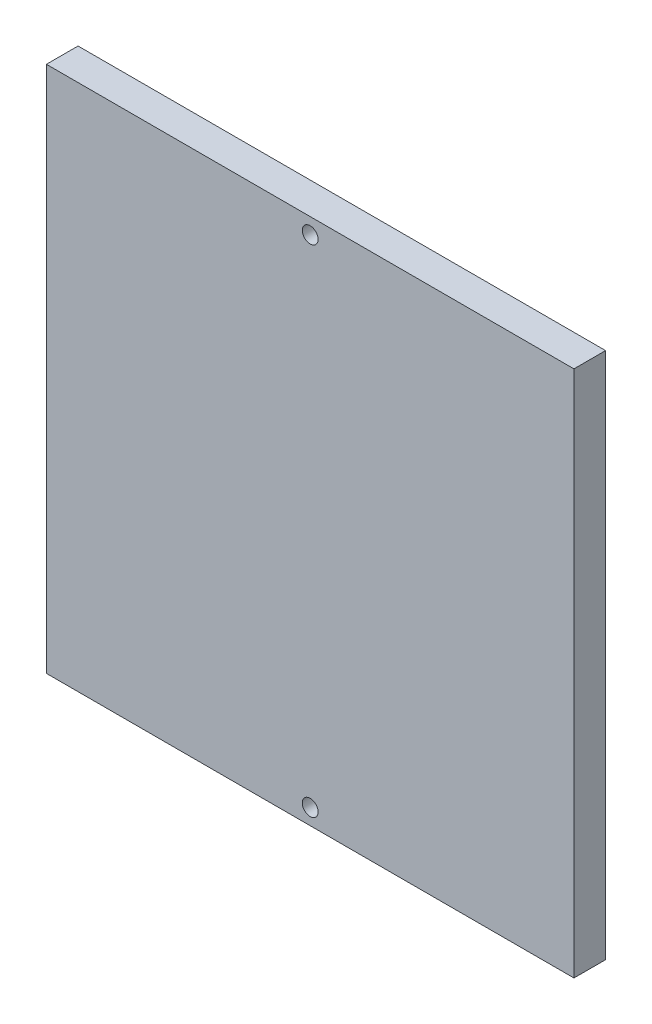
ISO-10303-21;
HEADER;
FILE_DESCRIPTION(('STEP AP214'),'2;1');
FILE_NAME('part.step','',(''),(''),'','','');
FILE_SCHEMA(('AUTOMOTIVE_DESIGN { 1 0 10303 214 1 1 1 1 }'));
ENDSEC;
DATA;
#1=APPLICATION_CONTEXT('core data for automotive mechanical design processes');
#2=APPLICATION_PROTOCOL_DEFINITION('international standard','automotive_design',2000,#1);
#3=PRODUCT_CONTEXT('',#1,'mechanical');
#4=PRODUCT('Part','Part','',(#3));
#5=PRODUCT_RELATED_PRODUCT_CATEGORY('part','',(#4));
#6=PRODUCT_DEFINITION_FORMATION('','',#4);
#7=PRODUCT_DEFINITION_CONTEXT('part definition',#1,'design');
#8=PRODUCT_DEFINITION('design','',#6,#7);
#9=PRODUCT_DEFINITION_SHAPE('','',#8);
#10=(LENGTH_UNIT() NAMED_UNIT(*) SI_UNIT(.MILLI.,.METRE.));
#11=(NAMED_UNIT(*) PLANE_ANGLE_UNIT() SI_UNIT($,.RADIAN.));
#12=(NAMED_UNIT(*) SI_UNIT($,.STERADIAN.) SOLID_ANGLE_UNIT());
#13=UNCERTAINTY_MEASURE_WITH_UNIT(LENGTH_MEASURE(1.E-05),#10,'distance_accuracy_value','');
#14=(GEOMETRIC_REPRESENTATION_CONTEXT(3) GLOBAL_UNCERTAINTY_ASSIGNED_CONTEXT((#13)) GLOBAL_UNIT_ASSIGNED_CONTEXT((#10,
#11,#12)) REPRESENTATION_CONTEXT('',''));
#15=CARTESIAN_POINT('',(0.,0.,0.));
#16=DIRECTION('',(0.,0.,1.));
#17=DIRECTION('',(1.,0.,0.));
#18=AXIS2_PLACEMENT_3D('',#15,#16,#17);
#19=CARTESIAN_POINT('',(0.,0.,6.));
#20=DIRECTION('',(0.,0.,-1.));
#21=DIRECTION('',(-1.,0.,0.));
#22=AXIS2_PLACEMENT_3D('',#19,#20,#21);
#23=PLANE('',#22);
#24=DIRECTION('',(0.,-1.,0.));
#25=VECTOR('',#24,1.);
#26=CARTESIAN_POINT('',(0.,-138.388923903618,6.));
#27=LINE('',#26,#25);
#28=CARTESIAN_POINT('',(0.,-38.3889239036183,6.));
#29=VERTEX_POINT('',#28);
#30=CARTESIAN_POINT('',(0.,-138.388923903618,6.));
#31=VERTEX_POINT('',#30);
#32=EDGE_CURVE('E85',#29,#31,#27,.T.);
#33=ORIENTED_EDGE('',*,*,#32,.T.);
#34=DIRECTION('',(1.,0.,0.));
#35=VECTOR('',#34,1.);
#36=CARTESIAN_POINT('',(100.,-138.388923903618,6.));
#37=LINE('',#36,#35);
#38=CARTESIAN_POINT('',(100.,-138.388923903618,6.));
#39=VERTEX_POINT('',#38);
#40=EDGE_CURVE('E80',#31,#39,#37,.T.);
#41=ORIENTED_EDGE('',*,*,#40,.T.);
#42=DIRECTION('',(0.,1.,0.));
#43=VECTOR('',#42,1.);
#44=CARTESIAN_POINT('',(100.,-38.3889239036183,6.));
#45=LINE('',#44,#43);
#46=CARTESIAN_POINT('',(100.,-38.3889239036183,6.));
#47=VERTEX_POINT('',#46);
#48=EDGE_CURVE('E83',#39,#47,#45,.T.);
#49=ORIENTED_EDGE('',*,*,#48,.T.);
#50=DIRECTION('',(-1.,0.,0.));
#51=VECTOR('',#50,1.);
#52=CARTESIAN_POINT('',(0.,-38.3889239036183,6.));
#53=LINE('',#52,#51);
#54=EDGE_CURVE('E50',#47,#29,#53,.T.);
#55=ORIENTED_EDGE('',*,*,#54,.T.);
#56=EDGE_LOOP('',(#33,#41,#49,#55));
#57=FACE_BOUND('',#56,.T.);
#58=CARTESIAN_POINT('',(50.,-41.3889239036183,6.));
#59=DIRECTION('',(0.,0.,1.));
#60=DIRECTION('',(1.,0.,0.));
#61=AXIS2_PLACEMENT_3D('',#58,#59,#60);
#62=CIRCLE('',#61,1.5);
#63=CARTESIAN_POINT('',(51.5,-41.3889239036183,6.));
#64=VERTEX_POINT('',#63);
#65=EDGE_CURVE('E100',#64,#64,#62,.T.);
#66=ORIENTED_EDGE('',*,*,#65,.F.);
#67=EDGE_LOOP('',(#66));
#68=FACE_BOUND('',#67,.T.);
#69=CARTESIAN_POINT('',(50.,-135.388923903618,6.));
#70=DIRECTION('',(0.,0.,1.));
#71=DIRECTION('',(1.,0.,0.));
#72=AXIS2_PLACEMENT_3D('',#69,#70,#71);
#73=CIRCLE('',#72,1.5);
#74=CARTESIAN_POINT('',(51.5,-135.388923903618,6.));
#75=VERTEX_POINT('',#74);
#76=EDGE_CURVE('E115',#75,#75,#73,.T.);
#77=ORIENTED_EDGE('',*,*,#76,.F.);
#78=EDGE_LOOP('',(#77));
#79=FACE_BOUND('',#78,.T.);
#80=ADVANCED_FACE('F33',(#57,#68,#79),#23,.F.);
#81=CARTESIAN_POINT('',(0.,0.,0.));
#82=DIRECTION('',(0.,0.,-1.));
#83=DIRECTION('',(-1.,0.,0.));
#84=AXIS2_PLACEMENT_3D('',#81,#82,#83);
#85=PLANE('',#84);
#86=CARTESIAN_POINT('',(50.,-41.3889239036183,0.));
#87=DIRECTION('',(0.,0.,1.));
#88=DIRECTION('',(1.,0.,0.));
#89=AXIS2_PLACEMENT_3D('',#86,#87,#88);
#90=CIRCLE('',#89,1.5);
#91=CARTESIAN_POINT('',(51.5,-41.3889239036183,0.));
#92=VERTEX_POINT('',#91);
#93=EDGE_CURVE('E112',#92,#92,#90,.T.);
#94=ORIENTED_EDGE('',*,*,#93,.T.);
#95=EDGE_LOOP('',(#94));
#96=FACE_BOUND('',#95,.T.);
#97=DIRECTION('',(0.,-1.,0.));
#98=VECTOR('',#97,1.);
#99=CARTESIAN_POINT('',(0.,-138.388923903618,0.));
#100=LINE('',#99,#98);
#101=CARTESIAN_POINT('',(0.,-38.3889239036183,0.));
#102=VERTEX_POINT('',#101);
#103=CARTESIAN_POINT('',(0.,-138.388923903618,0.));
#104=VERTEX_POINT('',#103);
#105=EDGE_CURVE('E97',#102,#104,#100,.T.);
#106=ORIENTED_EDGE('',*,*,#105,.F.);
#107=DIRECTION('',(-1.,0.,0.));
#108=VECTOR('',#107,1.);
#109=CARTESIAN_POINT('',(0.,-38.3889239036183,0.));
#110=LINE('',#109,#108);
#111=CARTESIAN_POINT('',(100.,-38.3889239036183,0.));
#112=VERTEX_POINT('',#111);
#113=EDGE_CURVE('E73',#112,#102,#110,.T.);
#114=ORIENTED_EDGE('',*,*,#113,.F.);
#115=DIRECTION('',(0.,1.,0.));
#116=VECTOR('',#115,1.);
#117=CARTESIAN_POINT('',(100.,-38.3889239036183,0.));
#118=LINE('',#117,#116);
#119=CARTESIAN_POINT('',(100.,-138.388923903618,0.));
#120=VERTEX_POINT('',#119);
#121=EDGE_CURVE('E67',#120,#112,#118,.T.);
#122=ORIENTED_EDGE('',*,*,#121,.F.);
#123=DIRECTION('',(1.,0.,0.));
#124=VECTOR('',#123,1.);
#125=CARTESIAN_POINT('',(100.,-138.388923903618,0.));
#126=LINE('',#125,#124);
#127=EDGE_CURVE('E89',#104,#120,#126,.T.);
#128=ORIENTED_EDGE('',*,*,#127,.F.);
#129=EDGE_LOOP('',(#106,#114,#122,#128));
#130=FACE_BOUND('',#129,.T.);
#131=CARTESIAN_POINT('',(50.,-135.388923903618,0.));
#132=DIRECTION('',(0.,0.,1.));
#133=DIRECTION('',(1.,0.,0.));
#134=AXIS2_PLACEMENT_3D('',#131,#132,#133);
#135=CIRCLE('',#134,1.5);
#136=CARTESIAN_POINT('',(51.5,-135.388923903618,0.));
#137=VERTEX_POINT('',#136);
#138=EDGE_CURVE('E118',#137,#137,#135,.T.);
#139=ORIENTED_EDGE('',*,*,#138,.T.);
#140=EDGE_LOOP('',(#139));
#141=FACE_BOUND('',#140,.T.);
#142=ADVANCED_FACE('F108',(#96,#130,#141),#85,.T.);
#143=CARTESIAN_POINT('',(0.,-138.388923903618,6.));
#144=DIRECTION('',(1.,0.,0.));
#145=DIRECTION('',(0.,0.,-1.));
#146=AXIS2_PLACEMENT_3D('',#143,#144,#145);
#147=PLANE('',#146);
#148=ORIENTED_EDGE('',*,*,#105,.T.);
#149=DIRECTION('',(0.,0.,-1.));
#150=VECTOR('',#149,1.);
#151=CARTESIAN_POINT('',(0.,-138.388923903618,6.));
#152=LINE('',#151,#150);
#153=EDGE_CURVE('E11',#31,#104,#152,.T.);
#154=ORIENTED_EDGE('',*,*,#153,.F.);
#155=ORIENTED_EDGE('',*,*,#32,.F.);
#156=DIRECTION('',(0.,0.,-1.));
#157=VECTOR('',#156,1.);
#158=CARTESIAN_POINT('',(0.,-38.3889239036183,6.));
#159=LINE('',#158,#157);
#160=EDGE_CURVE('E93',#29,#102,#159,.T.);
#161=ORIENTED_EDGE('',*,*,#160,.T.);
#162=EDGE_LOOP('',(#148,#154,#155,#161));
#163=FACE_BOUND('',#162,.T.);
#164=ADVANCED_FACE('F35',(#163),#147,.F.);
#165=CARTESIAN_POINT('',(100.,-138.388923903618,6.));
#166=DIRECTION('',(0.,1.,0.));
#167=DIRECTION('',(0.,0.,1.));
#168=AXIS2_PLACEMENT_3D('',#165,#166,#167);
#169=PLANE('',#168);
#170=ORIENTED_EDGE('',*,*,#127,.T.);
#171=DIRECTION('',(0.,0.,-1.));
#172=VECTOR('',#171,1.);
#173=CARTESIAN_POINT('',(100.,-138.388923903618,6.));
#174=LINE('',#173,#172);
#175=EDGE_CURVE('E42',#39,#120,#174,.T.);
#176=ORIENTED_EDGE('',*,*,#175,.F.);
#177=ORIENTED_EDGE('',*,*,#40,.F.);
#178=ORIENTED_EDGE('',*,*,#153,.T.);
#179=EDGE_LOOP('',(#170,#176,#177,#178));
#180=FACE_BOUND('',#179,.T.);
#181=ADVANCED_FACE('F88',(#180),#169,.F.);
#182=CARTESIAN_POINT('',(100.,-38.3889239036183,6.));
#183=DIRECTION('',(-1.,0.,0.));
#184=DIRECTION('',(0.,0.,1.));
#185=AXIS2_PLACEMENT_3D('',#182,#183,#184);
#186=PLANE('',#185);
#187=ORIENTED_EDGE('',*,*,#121,.T.);
#188=DIRECTION('',(0.,0.,-1.));
#189=VECTOR('',#188,1.);
#190=CARTESIAN_POINT('',(100.,-38.3889239036183,6.));
#191=LINE('',#190,#189);
#192=EDGE_CURVE('E90',#47,#112,#191,.T.);
#193=ORIENTED_EDGE('',*,*,#192,.F.);
#194=ORIENTED_EDGE('',*,*,#48,.F.);
#195=ORIENTED_EDGE('',*,*,#175,.T.);
#196=EDGE_LOOP('',(#187,#193,#194,#195));
#197=FACE_BOUND('',#196,.T.);
#198=ADVANCED_FACE('F91',(#197),#186,.F.);
#199=CARTESIAN_POINT('',(0.,-38.3889239036183,6.));
#200=DIRECTION('',(0.,-1.,0.));
#201=DIRECTION('',(0.,0.,-1.));
#202=AXIS2_PLACEMENT_3D('',#199,#200,#201);
#203=PLANE('',#202);
#204=ORIENTED_EDGE('',*,*,#113,.T.);
#205=ORIENTED_EDGE('',*,*,#160,.F.);
#206=ORIENTED_EDGE('',*,*,#54,.F.);
#207=ORIENTED_EDGE('',*,*,#192,.T.);
#208=EDGE_LOOP('',(#204,#205,#206,#207));
#209=FACE_BOUND('',#208,.T.);
#210=ADVANCED_FACE('F105',(#209),#203,.F.);
#211=CARTESIAN_POINT('',(50.,-41.3889239036183,6.));
#212=DIRECTION('',(0.,0.,-1.));
#213=DIRECTION('',(-1.,0.,0.));
#214=AXIS2_PLACEMENT_3D('',#211,#212,#213);
#215=CYLINDRICAL_SURFACE('',#214,1.5);
#216=ORIENTED_EDGE('',*,*,#65,.T.);
#217=EDGE_LOOP('',(#216));
#218=FACE_BOUND('',#217,.T.);
#219=ORIENTED_EDGE('',*,*,#93,.F.);
#220=EDGE_LOOP('',(#219));
#221=FACE_BOUND('',#220,.T.);
#222=ADVANCED_FACE('F135',(#218,#221),#215,.F.);
#223=CARTESIAN_POINT('',(50.,-135.388923903618,6.));
#224=DIRECTION('',(0.,0.,-1.));
#225=DIRECTION('',(-1.,0.,0.));
#226=AXIS2_PLACEMENT_3D('',#223,#224,#225);
#227=CYLINDRICAL_SURFACE('',#226,1.5);
#228=ORIENTED_EDGE('',*,*,#76,.T.);
#229=EDGE_LOOP('',(#228));
#230=FACE_BOUND('',#229,.T.);
#231=ORIENTED_EDGE('',*,*,#138,.F.);
#232=EDGE_LOOP('',(#231));
#233=FACE_BOUND('',#232,.T.);
#234=ADVANCED_FACE('F124',(#230,#233),#227,.F.);
#235=CLOSED_SHELL('',(#80,#142,#164,#181,#198,#210,#222,#234));
#236=MANIFOLD_SOLID_BREP('B2',#235);
#237=ADVANCED_BREP_SHAPE_REPRESENTATION('',(#18,#236),#14);
#238=SHAPE_DEFINITION_REPRESENTATION(#9,#237);
ENDSEC;
END-ISO-10303-21;
